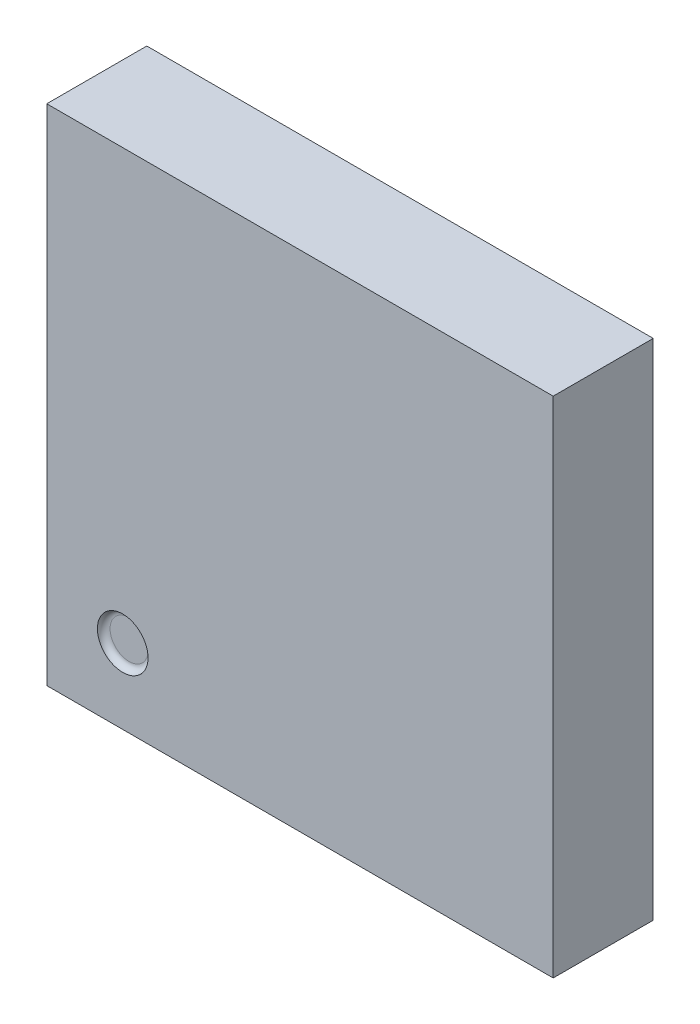
ISO-10303-21;
HEADER;
FILE_DESCRIPTION(('STEP AP214'),'2;1');
FILE_NAME('part.step','',(''),(''),'','','');
FILE_SCHEMA(('AUTOMOTIVE_DESIGN { 1 0 10303 214 1 1 1 1 }'));
ENDSEC;
DATA;
#1=APPLICATION_CONTEXT('core data for automotive mechanical design processes');
#2=APPLICATION_PROTOCOL_DEFINITION('international standard','automotive_design',2000,#1);
#3=PRODUCT_CONTEXT('',#1,'mechanical');
#4=PRODUCT('Part','Part','',(#3));
#5=PRODUCT_RELATED_PRODUCT_CATEGORY('part','',(#4));
#6=PRODUCT_DEFINITION_FORMATION('','',#4);
#7=PRODUCT_DEFINITION_CONTEXT('part definition',#1,'design');
#8=PRODUCT_DEFINITION('design','',#6,#7);
#9=PRODUCT_DEFINITION_SHAPE('','',#8);
#10=(LENGTH_UNIT() NAMED_UNIT(*) SI_UNIT(.MILLI.,.METRE.));
#11=(NAMED_UNIT(*) PLANE_ANGLE_UNIT() SI_UNIT($,.RADIAN.));
#12=(NAMED_UNIT(*) SI_UNIT($,.STERADIAN.) SOLID_ANGLE_UNIT());
#13=UNCERTAINTY_MEASURE_WITH_UNIT(LENGTH_MEASURE(1.E-05),#10,'distance_accuracy_value','');
#14=(GEOMETRIC_REPRESENTATION_CONTEXT(3) GLOBAL_UNCERTAINTY_ASSIGNED_CONTEXT((#13)) GLOBAL_UNIT_ASSIGNED_CONTEXT((#10,
#11,#12)) REPRESENTATION_CONTEXT('',''));
#15=CARTESIAN_POINT('',(0.,0.,0.));
#16=DIRECTION('',(0.,0.,1.));
#17=DIRECTION('',(1.,0.,0.));
#18=AXIS2_PLACEMENT_3D('',#15,#16,#17);
#19=CARTESIAN_POINT('',(0.800003414697,0.600003814697,0.750000655651));
#20=DIRECTION('',(0.,0.,-1.));
#21=DIRECTION('',(-1.,0.,0.));
#22=AXIS2_PLACEMENT_3D('',#19,#20,#21);
#23=PLANE('',#22);
#24=CARTESIAN_POINT('',(0.600003814697,0.600003814697,0.750000655651));
#25=DIRECTION('',(0.,0.,-1.));
#26=DIRECTION('',(1.,0.,0.));
#27=AXIS2_PLACEMENT_3D('',#24,#25,#26);
#28=CIRCLE('',#27,0.1499996);
#29=CARTESIAN_POINT('',(0.750003414697,0.600003814697,0.750000655651));
#30=VERTEX_POINT('',#29);
#31=EDGE_CURVE('E104',#30,#30,#28,.F.);
#32=ORIENTED_EDGE('',*,*,#31,.T.);
#33=EDGE_LOOP('',(#32));
#34=FACE_BOUND('',#33,.T.);
#35=ADVANCED_FACE('F16',(#34),#23,.F.);
#36=CARTESIAN_POINT('',(0.600003814697,0.600003814697,0.800000655651));
#37=DIRECTION('',(0.,0.,-1.));
#38=DIRECTION('',(1.,0.,0.));
#39=AXIS2_PLACEMENT_3D('',#36,#37,#38);
#40=TOROIDAL_SURFACE('',#39,0.1499996,0.05);
#41=CARTESIAN_POINT('',(0.600003814697,0.600003814697,0.800000934631));
#42=DIRECTION('',(0.,0.,-1.));
#43=DIRECTION('',(-1.,0.,0.));
#44=AXIS2_PLACEMENT_3D('',#41,#42,#43);
#45=CIRCLE('',#44,0.199999599999222);
#46=CARTESIAN_POINT('',(0.400004214697778,0.600003814697,0.800000934631));
#47=VERTEX_POINT('',#46);
#48=EDGE_CURVE('E20',#47,#47,#45,.T.);
#49=ORIENTED_EDGE('',*,*,#48,.F.);
#50=EDGE_LOOP('',(#49));
#51=FACE_BOUND('',#50,.T.);
#52=ORIENTED_EDGE('',*,*,#31,.F.);
#53=EDGE_LOOP('',(#52));
#54=FACE_BOUND('',#53,.T.);
#55=ADVANCED_FACE('F88',(#51,#54),#40,.F.);
#56=CARTESIAN_POINT('',(4.45878999944E-07,3.989998811182,0.800000934631));
#57=DIRECTION('',(0.,0.,1.));
#58=DIRECTION('',(1.,0.,0.));
#59=AXIS2_PLACEMENT_3D('',#56,#57,#58);
#60=PLANE('',#59);
#61=DIRECTION('',(1.,0.,0.));
#62=VECTOR('',#61,1.);
#63=CARTESIAN_POINT('',(4.000002605879,0.009999151182,0.800000934631));
#64=LINE('',#63,#62);
#65=CARTESIAN_POINT('',(4.000002605879,0.00999915118200015,0.800000934631));
#66=VERTEX_POINT('',#65);
#67=CARTESIAN_POINT('',(4.45878999838175E-07,0.0099991511820001,0.800000934631));
#68=VERTEX_POINT('',#67);
#69=EDGE_CURVE('E58',#66,#68,#64,.F.);
#70=ORIENTED_EDGE('',*,*,#69,.F.);
#71=DIRECTION('',(0.,1.,0.));
#72=VECTOR('',#71,1.);
#73=CARTESIAN_POINT('',(4.000002605879,3.989998811182,0.800000934631));
#74=LINE('',#73,#72);
#75=CARTESIAN_POINT('',(4.000002605879,3.989998811182,0.800000934631));
#76=VERTEX_POINT('',#75);
#77=EDGE_CURVE('E53',#76,#66,#74,.F.);
#78=ORIENTED_EDGE('',*,*,#77,.F.);
#79=DIRECTION('',(1.,0.,0.));
#80=VECTOR('',#79,1.);
#81=CARTESIAN_POINT('',(4.45878999944E-07,3.989998811182,0.800000934631));
#82=LINE('',#81,#80);
#83=CARTESIAN_POINT('',(4.45878999944E-07,3.989998811182,0.800000934631));
#84=VERTEX_POINT('',#83);
#85=EDGE_CURVE('E72',#84,#76,#82,.T.);
#86=ORIENTED_EDGE('',*,*,#85,.F.);
#87=DIRECTION('',(0.,1.,0.));
#88=VECTOR('',#87,1.);
#89=CARTESIAN_POINT('',(4.45878999944E-07,0.009999151182,0.800000934631));
#90=LINE('',#89,#88);
#91=EDGE_CURVE('E67',#68,#84,#90,.T.);
#92=ORIENTED_EDGE('',*,*,#91,.F.);
#93=EDGE_LOOP('',(#70,#78,#86,#92));
#94=FACE_BOUND('',#93,.T.);
#95=ORIENTED_EDGE('',*,*,#48,.T.);
#96=EDGE_LOOP('',(#95));
#97=FACE_BOUND('',#96,.T.);
#98=ADVANCED_FACE('F70',(#94,#97),#60,.T.);
#99=CARTESIAN_POINT('',(4.45878999944E-07,0.009999151182,0.009999974630773));
#100=DIRECTION('',(-1.,0.,0.));
#101=DIRECTION('',(0.,0.,1.));
#102=AXIS2_PLACEMENT_3D('',#99,#100,#101);
#103=PLANE('',#102);
#104=DIRECTION('',(0.,0.,1.));
#105=VECTOR('',#104,1.);
#106=CARTESIAN_POINT('',(4.45878999944E-07,3.989998811182,0.009999974630773));
#107=LINE('',#106,#105);
#108=CARTESIAN_POINT('',(4.45878999944E-07,3.989998811182,0.009999974630773));
#109=VERTEX_POINT('',#108);
#110=EDGE_CURVE('E188',#109,#84,#107,.T.);
#111=ORIENTED_EDGE('',*,*,#110,.F.);
#112=DIRECTION('',(0.,1.,0.));
#113=VECTOR('',#112,1.);
#114=CARTESIAN_POINT('',(4.45878999944E-07,3.989998811182,0.009999974630773));
#115=LINE('',#114,#113);
#116=CARTESIAN_POINT('',(4.45878999838175E-07,0.00999915118200005,0.009999974630773));
#117=VERTEX_POINT('',#116);
#118=EDGE_CURVE('E79',#109,#117,#115,.F.);
#119=ORIENTED_EDGE('',*,*,#118,.T.);
#120=DIRECTION('',(0.,0.,-1.));
#121=VECTOR('',#120,1.);
#122=CARTESIAN_POINT('',(4.45878999520699E-07,0.009999151182,0.009999974630773));
#123=LINE('',#122,#121);
#124=EDGE_CURVE('E63',#68,#117,#123,.T.);
#125=ORIENTED_EDGE('',*,*,#124,.F.);
#126=ORIENTED_EDGE('',*,*,#91,.T.);
#127=EDGE_LOOP('',(#111,#119,#125,#126));
#128=FACE_BOUND('',#127,.T.);
#129=ADVANCED_FACE('F78',(#128),#103,.T.);
#130=CARTESIAN_POINT('',(4.000002605879,0.009999151182,0.009999974630773));
#131=DIRECTION('',(0.,-1.,0.));
#132=DIRECTION('',(0.,0.,-1.));
#133=AXIS2_PLACEMENT_3D('',#130,#131,#132);
#134=PLANE('',#133);
#135=ORIENTED_EDGE('',*,*,#124,.T.);
#136=DIRECTION('',(1.,0.,0.));
#137=VECTOR('',#136,1.);
#138=CARTESIAN_POINT('',(4.45878999944E-07,0.0099991511820002,0.009999974630773));
#139=LINE('',#138,#137);
#140=CARTESIAN_POINT('',(4.000002605879,0.0099991511820001,0.009999974630773));
#141=VERTEX_POINT('',#140);
#142=EDGE_CURVE('E189',#117,#141,#139,.T.);
#143=ORIENTED_EDGE('',*,*,#142,.T.);
#144=DIRECTION('',(0.,0.,-1.));
#145=VECTOR('',#144,1.);
#146=CARTESIAN_POINT('',(4.000002605879,0.0099991511820002,0.009999974630773));
#147=LINE('',#146,#145);
#148=EDGE_CURVE('E65',#66,#141,#147,.T.);
#149=ORIENTED_EDGE('',*,*,#148,.F.);
#150=ORIENTED_EDGE('',*,*,#69,.T.);
#151=EDGE_LOOP('',(#135,#143,#149,#150));
#152=FACE_BOUND('',#151,.T.);
#153=ADVANCED_FACE('F60',(#152),#134,.T.);
#154=CARTESIAN_POINT('',(4.000002605879,3.989998811182,0.009999974630773));
#155=DIRECTION('',(1.,0.,0.));
#156=DIRECTION('',(0.,0.,-1.));
#157=AXIS2_PLACEMENT_3D('',#154,#155,#156);
#158=PLANE('',#157);
#159=ORIENTED_EDGE('',*,*,#148,.T.);
#160=DIRECTION('',(0.,1.,0.));
#161=VECTOR('',#160,1.);
#162=CARTESIAN_POINT('',(4.000002605879,3.989998811182,0.009999974630773));
#163=LINE('',#162,#161);
#164=CARTESIAN_POINT('',(4.000002605879,3.989998811182,0.009999974630773));
#165=VERTEX_POINT('',#164);
#166=EDGE_CURVE('E26',#141,#165,#163,.T.);
#167=ORIENTED_EDGE('',*,*,#166,.T.);
#168=DIRECTION('',(0.,0.,1.));
#169=VECTOR('',#168,1.);
#170=CARTESIAN_POINT('',(4.000002605879,3.989998811182,0.009999974630773));
#171=LINE('',#170,#169);
#172=EDGE_CURVE('E34',#76,#165,#171,.F.);
#173=ORIENTED_EDGE('',*,*,#172,.F.);
#174=ORIENTED_EDGE('',*,*,#77,.T.);
#175=EDGE_LOOP('',(#159,#167,#173,#174));
#176=FACE_BOUND('',#175,.T.);
#177=ADVANCED_FACE('F128',(#176),#158,.T.);
#178=CARTESIAN_POINT('',(4.45878999944E-07,3.989998811182,0.009999974630773));
#179=DIRECTION('',(0.,1.,0.));
#180=DIRECTION('',(0.,0.,1.));
#181=AXIS2_PLACEMENT_3D('',#178,#179,#180);
#182=PLANE('',#181);
#183=ORIENTED_EDGE('',*,*,#172,.T.);
#184=DIRECTION('',(1.,0.,0.));
#185=VECTOR('',#184,1.);
#186=CARTESIAN_POINT('',(4.45878999944E-07,3.989998811182,0.009999974630773));
#187=LINE('',#186,#185);
#188=EDGE_CURVE('E10',#165,#109,#187,.F.);
#189=ORIENTED_EDGE('',*,*,#188,.T.);
#190=ORIENTED_EDGE('',*,*,#110,.T.);
#191=ORIENTED_EDGE('',*,*,#85,.T.);
#192=EDGE_LOOP('',(#183,#189,#190,#191));
#193=FACE_BOUND('',#192,.T.);
#194=ADVANCED_FACE('F122',(#193),#182,.T.);
#195=CARTESIAN_POINT('',(4.45878999944E-07,3.989998811182,0.009999974630773));
#196=DIRECTION('',(0.,0.,1.));
#197=DIRECTION('',(1.,0.,0.));
#198=AXIS2_PLACEMENT_3D('',#195,#196,#197);
#199=PLANE('',#198);
#200=ORIENTED_EDGE('',*,*,#166,.F.);
#201=ORIENTED_EDGE('',*,*,#142,.F.);
#202=ORIENTED_EDGE('',*,*,#118,.F.);
#203=ORIENTED_EDGE('',*,*,#188,.F.);
#204=EDGE_LOOP('',(#200,#201,#202,#203));
#205=FACE_BOUND('',#204,.T.);
#206=ADVANCED_FACE('F120',(#205),#199,.F.);
#207=CLOSED_SHELL('',(#35,#55,#98,#129,#153,#177,#194,#206));
#208=MANIFOLD_SOLID_BREP('B1',#207);
#209=ADVANCED_BREP_SHAPE_REPRESENTATION('',(#18,#208),#14);
#210=SHAPE_DEFINITION_REPRESENTATION(#9,#209);
ENDSEC;
END-ISO-10303-21;
